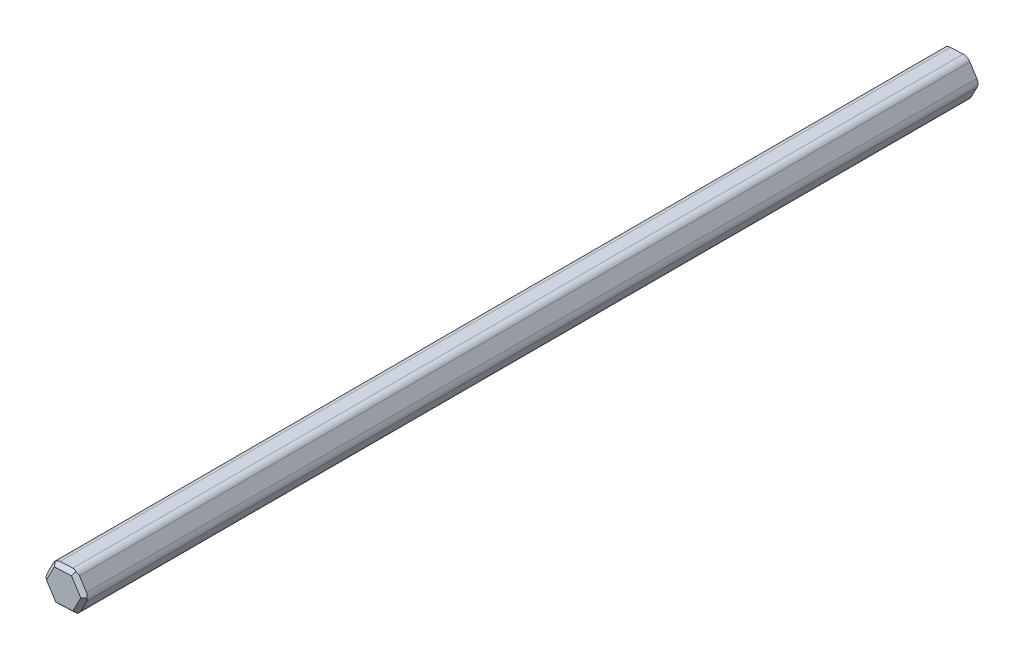
ISO-10303-21;
HEADER;
FILE_DESCRIPTION(('STEP AP214'),'2;1');
FILE_NAME('part.step','',(''),(''),'','','');
FILE_SCHEMA(('AUTOMOTIVE_DESIGN { 1 0 10303 214 1 1 1 1 }'));
ENDSEC;
DATA;
#1=APPLICATION_CONTEXT('core data for automotive mechanical design processes');
#2=APPLICATION_PROTOCOL_DEFINITION('international standard','automotive_design',2000,#1);
#3=PRODUCT_CONTEXT('',#1,'mechanical');
#4=PRODUCT('Part','Part','',(#3));
#5=PRODUCT_RELATED_PRODUCT_CATEGORY('part','',(#4));
#6=PRODUCT_DEFINITION_FORMATION('','',#4);
#7=PRODUCT_DEFINITION_CONTEXT('part definition',#1,'design');
#8=PRODUCT_DEFINITION('design','',#6,#7);
#9=PRODUCT_DEFINITION_SHAPE('','',#8);
#10=(LENGTH_UNIT() NAMED_UNIT(*) SI_UNIT(.MILLI.,.METRE.));
#11=(NAMED_UNIT(*) PLANE_ANGLE_UNIT() SI_UNIT($,.RADIAN.));
#12=(NAMED_UNIT(*) SI_UNIT($,.STERADIAN.) SOLID_ANGLE_UNIT());
#13=UNCERTAINTY_MEASURE_WITH_UNIT(LENGTH_MEASURE(1.E-05),#10,'distance_accuracy_value','');
#14=(GEOMETRIC_REPRESENTATION_CONTEXT(3) GLOBAL_UNCERTAINTY_ASSIGNED_CONTEXT((#13)) GLOBAL_UNIT_ASSIGNED_CONTEXT((#10,
#11,#12)) REPRESENTATION_CONTEXT('',''));
#15=CARTESIAN_POINT('',(0.,0.,0.));
#16=DIRECTION('',(0.,0.,1.));
#17=DIRECTION('',(1.,0.,0.));
#18=AXIS2_PLACEMENT_3D('',#15,#16,#17);
#19=CARTESIAN_POINT('',(0.673520983785885,1.30265222439968,60.96));
#20=DIRECTION('',(0.04639702478252,-0.998923078165346,0.));
#21=DIRECTION('',(0.998923078165346,0.04639702478252,0.));
#22=AXIS2_PLACEMENT_3D('',#19,#20,#21);
#23=PLANE('',#22);
#24=DIRECTION('',(-0.998923078165346,-0.04639702478252,0.));
#25=VECTOR('',#24,1.);
#26=CARTESIAN_POINT('',(0.673520983785885,1.30265222439968,0.));
#27=LINE('',#26,#25);
#28=CARTESIAN_POINT('',(0.380542901682011,1.2890442583478,0.));
#29=VERTEX_POINT('',#28);
#30=CARTESIAN_POINT('',(-0.498391344629611,1.24822036019218,0.));
#31=VERTEX_POINT('',#30);
#32=EDGE_CURVE('E225',#29,#31,#27,.T.);
#33=ORIENTED_EDGE('',*,*,#32,.T.);
#34=DIRECTION('',(0.,0.,-1.));
#35=VECTOR('',#34,1.);
#36=CARTESIAN_POINT('',(-0.498391344629611,1.24822036019218,60.96));
#37=LINE('',#36,#35);
#38=CARTESIAN_POINT('',(-0.498391344629611,1.24822036019218,60.706));
#39=VERTEX_POINT('',#38);
#40=EDGE_CURVE('E245',#31,#39,#37,.F.);
#41=ORIENTED_EDGE('',*,*,#40,.T.);
#42=DIRECTION('',(0.998923078165346,0.04639702478252,0.));
#43=VECTOR('',#42,1.);
#44=CARTESIAN_POINT('',(0.673520983785885,1.30265222439968,60.706));
#45=LINE('',#44,#43);
#46=CARTESIAN_POINT('',(0.380542901682011,1.2890442583478,60.706));
#47=VERTEX_POINT('',#46);
#48=EDGE_CURVE('E211',#39,#47,#45,.T.);
#49=ORIENTED_EDGE('',*,*,#48,.T.);
#50=DIRECTION('',(0.,0.,-1.));
#51=VECTOR('',#50,1.);
#52=CARTESIAN_POINT('',(0.380542901682011,1.2890442583478,60.96));
#53=LINE('',#52,#51);
#54=EDGE_CURVE('E242',#47,#29,#53,.T.);
#55=ORIENTED_EDGE('',*,*,#54,.T.);
#56=EDGE_LOOP('',(#33,#41,#49,#55));
#57=FACE_BOUND('',#56,.T.);
#58=ADVANCED_FACE('F33',(#57),#23,.F.);
#59=CARTESIAN_POINT('',(-0.791369426733485,1.2346123941403,60.96));
#60=DIRECTION('',(0.888291274508999,-0.459280536960994,0.));
#61=DIRECTION('',(0.459280536960994,0.888291274508999,0.));
#62=AXIS2_PLACEMENT_3D('',#59,#60,#61);
#63=PLANE('',#62);
#64=DIRECTION('',(0.459280536960994,0.888291274508999,0.));
#65=VECTOR('',#64,1.);
#66=CARTESIAN_POINT('',(-0.791369426733485,1.2346123941403,60.706));
#67=LINE('',#66,#65);
#68=CARTESIAN_POINT('',(-1.33018621376219,0.192490614620559,60.706));
#69=VERTEX_POINT('',#68);
#70=CARTESIAN_POINT('',(-0.926073623490662,0.974081949260367,60.706));
#71=VERTEX_POINT('',#70);
#72=EDGE_CURVE('E214',#69,#71,#67,.T.);
#73=ORIENTED_EDGE('',*,*,#72,.T.);
#74=DIRECTION('',(0.,0.,-1.));
#75=VECTOR('',#74,1.);
#76=CARTESIAN_POINT('',(-0.926073623490662,0.974081949260367,60.96));
#77=LINE('',#76,#75);
#78=CARTESIAN_POINT('',(-0.926073623490662,0.974081949260367,0.));
#79=VERTEX_POINT('',#78);
#80=EDGE_CURVE('E227',#71,#79,#77,.T.);
#81=ORIENTED_EDGE('',*,*,#80,.T.);
#82=DIRECTION('',(-0.459280536960994,-0.888291274508999,0.));
#83=VECTOR('',#82,1.);
#84=CARTESIAN_POINT('',(-0.791369426733485,1.2346123941403,0.));
#85=LINE('',#84,#83);
#86=CARTESIAN_POINT('',(-1.33018621376219,0.192490614620559,0.));
#87=VERTEX_POINT('',#86);
#88=EDGE_CURVE('E311',#79,#87,#85,.T.);
#89=ORIENTED_EDGE('',*,*,#88,.T.);
#90=DIRECTION('',(0.,0.,-1.));
#91=VECTOR('',#90,1.);
#92=CARTESIAN_POINT('',(-1.33018621376219,0.192490614620559,60.96));
#93=LINE('',#92,#91);
#94=EDGE_CURVE('E217',#87,#69,#93,.F.);
#95=ORIENTED_EDGE('',*,*,#94,.T.);
#96=EDGE_LOOP('',(#73,#81,#89,#95));
#97=FACE_BOUND('',#96,.T.);
#98=ADVANCED_FACE('F308',(#97),#63,.F.);
#99=CARTESIAN_POINT('',(-1.46489041051937,-0.0680398302593764,60.96));
#100=DIRECTION('',(0.841894249726478,0.539642541204352,0.));
#101=DIRECTION('',(-0.539642541204352,0.841894249726478,0.));
#102=AXIS2_PLACEMENT_3D('',#99,#100,#101);
#103=PLANE('',#102);
#104=DIRECTION('',(-0.539642541204352,0.841894249726478,0.));
#105=VECTOR('',#104,1.);
#106=CARTESIAN_POINT('',(-1.46489041051937,-0.0680398302593764,60.706));
#107=LINE('',#106,#105);
#108=CARTESIAN_POINT('',(-0.831794869132581,-1.05572974557162,60.706));
#109=VERTEX_POINT('',#108);
#110=CARTESIAN_POINT('',(-1.30661652517267,-0.314962309087437,60.706));
#111=VERTEX_POINT('',#110);
#112=EDGE_CURVE('E200',#109,#111,#107,.T.);
#113=ORIENTED_EDGE('',*,*,#112,.T.);
#114=DIRECTION('',(0.,0.,-1.));
#115=VECTOR('',#114,1.);
#116=CARTESIAN_POINT('',(-1.30661652517267,-0.314962309087437,60.96));
#117=LINE('',#116,#115);
#118=CARTESIAN_POINT('',(-1.30661652517267,-0.314962309087437,0.));
#119=VERTEX_POINT('',#118);
#120=EDGE_CURVE('E274',#111,#119,#117,.T.);
#121=ORIENTED_EDGE('',*,*,#120,.T.);
#122=DIRECTION('',(0.539642541204352,-0.841894249726478,0.));
#123=VECTOR('',#122,1.);
#124=CARTESIAN_POINT('',(-1.46489041051937,-0.0680398302593764,0.));
#125=LINE('',#124,#123);
#126=CARTESIAN_POINT('',(-0.831794869132581,-1.05572974557162,0.));
#127=VERTEX_POINT('',#126);
#128=EDGE_CURVE('E341',#119,#127,#125,.T.);
#129=ORIENTED_EDGE('',*,*,#128,.T.);
#130=DIRECTION('',(0.,0.,-1.));
#131=VECTOR('',#130,1.);
#132=CARTESIAN_POINT('',(-0.831794869132581,-1.05572974557162,60.96));
#133=LINE('',#132,#131);
#134=EDGE_CURVE('E272',#127,#109,#133,.F.);
#135=ORIENTED_EDGE('',*,*,#134,.T.);
#136=EDGE_LOOP('',(#113,#121,#129,#135));
#137=FACE_BOUND('',#136,.T.);
#138=ADVANCED_FACE('F350',(#137),#103,.F.);
#139=CARTESIAN_POINT('',(-0.673520983785884,-1.30265222439968,60.96));
#140=DIRECTION('',(-0.0463970247825201,0.998923078165346,0.));
#141=DIRECTION('',(-0.998923078165346,-0.0463970247825201,0.));
#142=AXIS2_PLACEMENT_3D('',#139,#140,#141);
#143=PLANE('',#142);
#144=DIRECTION('',(0.998923078165346,0.0463970247825201,0.));
#145=VECTOR('',#144,1.);
#146=CARTESIAN_POINT('',(-0.673520983785884,-1.30265222439968,0.));
#147=LINE('',#146,#145);
#148=CARTESIAN_POINT('',(-0.380542901682009,-1.2890442583478,0.));
#149=VERTEX_POINT('',#148);
#150=CARTESIAN_POINT('',(0.498391344629613,-1.24822036019218,0.));
#151=VERTEX_POINT('',#150);
#152=EDGE_CURVE('E340',#149,#151,#147,.T.);
#153=ORIENTED_EDGE('',*,*,#152,.T.);
#154=DIRECTION('',(0.,0.,-1.));
#155=VECTOR('',#154,1.);
#156=CARTESIAN_POINT('',(0.498391344629612,-1.24822036019218,60.96));
#157=LINE('',#156,#155);
#158=CARTESIAN_POINT('',(0.498391344629612,-1.24822036019218,60.706));
#159=VERTEX_POINT('',#158);
#160=EDGE_CURVE('E262',#151,#159,#157,.F.);
#161=ORIENTED_EDGE('',*,*,#160,.T.);
#162=DIRECTION('',(-0.998923078165346,-0.0463970247825201,0.));
#163=VECTOR('',#162,1.);
#164=CARTESIAN_POINT('',(-0.673520983785884,-1.30265222439968,60.706));
#165=LINE('',#164,#163);
#166=CARTESIAN_POINT('',(-0.38054290168201,-1.2890442583478,60.706));
#167=VERTEX_POINT('',#166);
#168=EDGE_CURVE('E203',#159,#167,#165,.T.);
#169=ORIENTED_EDGE('',*,*,#168,.T.);
#170=DIRECTION('',(0.,0.,-1.));
#171=VECTOR('',#170,1.);
#172=CARTESIAN_POINT('',(-0.38054290168201,-1.2890442583478,60.96));
#173=LINE('',#172,#171);
#174=EDGE_CURVE('E259',#167,#149,#173,.T.);
#175=ORIENTED_EDGE('',*,*,#174,.T.);
#176=EDGE_LOOP('',(#153,#161,#169,#175));
#177=FACE_BOUND('',#176,.T.);
#178=ADVANCED_FACE('F359',(#177),#143,.F.);
#179=CARTESIAN_POINT('',(0.791369426733486,-1.2346123941403,60.96));
#180=DIRECTION('',(-0.888291274508999,0.459280536960994,0.));
#181=DIRECTION('',(-0.459280536960994,-0.888291274508999,0.));
#182=AXIS2_PLACEMENT_3D('',#179,#180,#181);
#183=PLANE('',#182);
#184=DIRECTION('',(-0.459280536960994,-0.888291274508999,0.));
#185=VECTOR('',#184,1.);
#186=CARTESIAN_POINT('',(0.791369426733486,-1.2346123941403,60.706));
#187=LINE('',#186,#185);
#188=CARTESIAN_POINT('',(1.33018621376219,-0.192490614620559,60.706));
#189=VERTEX_POINT('',#188);
#190=CARTESIAN_POINT('',(0.926073623490663,-0.974081949260367,60.706));
#191=VERTEX_POINT('',#190);
#192=EDGE_CURVE('E206',#189,#191,#187,.T.);
#193=ORIENTED_EDGE('',*,*,#192,.T.);
#194=DIRECTION('',(0.,0.,-1.));
#195=VECTOR('',#194,1.);
#196=CARTESIAN_POINT('',(0.926073623490663,-0.974081949260367,60.96));
#197=LINE('',#196,#195);
#198=CARTESIAN_POINT('',(0.926073623490663,-0.974081949260367,0.));
#199=VERTEX_POINT('',#198);
#200=EDGE_CURVE('E256',#191,#199,#197,.T.);
#201=ORIENTED_EDGE('',*,*,#200,.T.);
#202=DIRECTION('',(0.459280536960994,0.888291274508999,0.));
#203=VECTOR('',#202,1.);
#204=CARTESIAN_POINT('',(0.791369426733486,-1.2346123941403,0.));
#205=LINE('',#204,#203);
#206=CARTESIAN_POINT('',(1.33018621376219,-0.192490614620559,0.));
#207=VERTEX_POINT('',#206);
#208=EDGE_CURVE('E188',#199,#207,#205,.T.);
#209=ORIENTED_EDGE('',*,*,#208,.T.);
#210=DIRECTION('',(0.,0.,-1.));
#211=VECTOR('',#210,1.);
#212=CARTESIAN_POINT('',(1.33018621376219,-0.192490614620559,60.96));
#213=LINE('',#212,#211);
#214=EDGE_CURVE('E254',#207,#189,#213,.F.);
#215=ORIENTED_EDGE('',*,*,#214,.T.);
#216=EDGE_LOOP('',(#193,#201,#209,#215));
#217=FACE_BOUND('',#216,.T.);
#218=ADVANCED_FACE('F332',(#217),#183,.F.);
#219=CARTESIAN_POINT('',(1.46489041051937,0.0680398302593764,60.96));
#220=DIRECTION('',(-0.841894249726478,-0.539642541204352,0.));
#221=DIRECTION('',(0.539642541204352,-0.841894249726478,0.));
#222=AXIS2_PLACEMENT_3D('',#219,#220,#221);
#223=PLANE('',#222);
#224=DIRECTION('',(-0.539642541204352,0.841894249726478,0.));
#225=VECTOR('',#224,1.);
#226=CARTESIAN_POINT('',(1.46489041051937,0.0680398302593764,0.));
#227=LINE('',#226,#225);
#228=CARTESIAN_POINT('',(1.30661652517267,0.314962309087437,0.));
#229=VERTEX_POINT('',#228);
#230=CARTESIAN_POINT('',(0.831794869132581,1.05572974557162,0.));
#231=VERTEX_POINT('',#230);
#232=EDGE_CURVE('E186',#229,#231,#227,.T.);
#233=ORIENTED_EDGE('',*,*,#232,.T.);
#234=DIRECTION('',(0.,0.,-1.));
#235=VECTOR('',#234,1.);
#236=CARTESIAN_POINT('',(0.831794869132582,1.05572974557162,60.96));
#237=LINE('',#236,#235);
#238=CARTESIAN_POINT('',(0.831794869132582,1.05572974557162,60.706));
#239=VERTEX_POINT('',#238);
#240=EDGE_CURVE('E54',#231,#239,#237,.F.);
#241=ORIENTED_EDGE('',*,*,#240,.T.);
#242=DIRECTION('',(0.539642541204352,-0.841894249726478,0.));
#243=VECTOR('',#242,1.);
#244=CARTESIAN_POINT('',(1.46489041051937,0.0680398302593764,60.706));
#245=LINE('',#244,#243);
#246=CARTESIAN_POINT('',(1.30661652517267,0.314962309087437,60.706));
#247=VERTEX_POINT('',#246);
#248=EDGE_CURVE('E209',#239,#247,#245,.T.);
#249=ORIENTED_EDGE('',*,*,#248,.T.);
#250=DIRECTION('',(0.,0.,-1.));
#251=VECTOR('',#250,1.);
#252=CARTESIAN_POINT('',(1.30661652517267,0.314962309087437,60.96));
#253=LINE('',#252,#251);
#254=EDGE_CURVE('E281',#247,#229,#253,.T.);
#255=ORIENTED_EDGE('',*,*,#254,.T.);
#256=EDGE_LOOP('',(#233,#241,#249,#255));
#257=FACE_BOUND('',#256,.T.);
#258=ADVANCED_FACE('F286',(#257),#223,.F.);
#259=CARTESIAN_POINT('',(0.,0.,60.96));
#260=DIRECTION('',(0.,0.,1.));
#261=DIRECTION('',(1.,0.,0.));
#262=AXIS2_PLACEMENT_3D('',#259,#260,#261);
#263=PLANE('',#262);
#264=DIRECTION('',(-0.459280536960994,-0.888291274508999,0.));
#265=VECTOR('',#264,1.);
#266=CARTESIAN_POINT('',(-1.23926442679409,-0.184697086647467,60.96));
#267=LINE('',#266,#265);
#268=CARTESIAN_POINT('',(-0.633095541386791,0.987689915312246,60.96));
#269=VERTEX_POINT('',#268);
#270=CARTESIAN_POINT('',(-1.1719123284155,-0.0544318642075016,60.96));
#271=VERTEX_POINT('',#270);
#272=EDGE_CURVE('E162',#269,#271,#267,.T.);
#273=ORIENTED_EDGE('',*,*,#272,.T.);
#274=DIRECTION('',(0.539642541204352,-0.841894249726478,0.));
#275=VECTOR('',#274,1.);
#276=CARTESIAN_POINT('',(-0.459679844355362,-1.16558301893377,60.96));
#277=LINE('',#276,#275);
#278=CARTESIAN_POINT('',(-0.538816787028709,-1.04212177951975,60.96));
#279=VERTEX_POINT('',#278);
#280=EDGE_CURVE('E198',#271,#279,#277,.T.);
#281=ORIENTED_EDGE('',*,*,#280,.T.);
#282=DIRECTION('',(0.998923078165346,0.0463970247825201,0.));
#283=VECTOR('',#282,1.);
#284=CARTESIAN_POINT('',(0.779584582438726,-0.980885932286309,60.96));
#285=LINE('',#284,#283);
#286=CARTESIAN_POINT('',(0.633095541386791,-0.987689915312246,60.96));
#287=VERTEX_POINT('',#286);
#288=EDGE_CURVE('E195',#279,#287,#285,.T.);
#289=ORIENTED_EDGE('',*,*,#288,.T.);
#290=DIRECTION('',(0.459280536960994,0.888291274508999,0.));
#291=VECTOR('',#290,1.);
#292=CARTESIAN_POINT('',(1.23926442679409,0.184697086647467,60.96));
#293=LINE('',#292,#291);
#294=CARTESIAN_POINT('',(1.1719123284155,0.0544318642075016,60.96));
#295=VERTEX_POINT('',#294);
#296=EDGE_CURVE('E193',#287,#295,#293,.T.);
#297=ORIENTED_EDGE('',*,*,#296,.T.);
#298=DIRECTION('',(-0.539642541204352,0.841894249726478,0.));
#299=VECTOR('',#298,1.);
#300=CARTESIAN_POINT('',(0.459679844355363,1.16558301893377,60.96));
#301=LINE('',#300,#299);
#302=CARTESIAN_POINT('',(0.53881678702871,1.04212177951975,60.96));
#303=VERTEX_POINT('',#302);
#304=EDGE_CURVE('E166',#295,#303,#301,.T.);
#305=ORIENTED_EDGE('',*,*,#304,.T.);
#306=DIRECTION('',(-0.998923078165346,-0.04639702478252,0.));
#307=VECTOR('',#306,1.);
#308=CARTESIAN_POINT('',(-0.779584582438726,0.980885932286309,60.96));
#309=LINE('',#308,#307);
#310=EDGE_CURVE('E157',#303,#269,#309,.T.);
#311=ORIENTED_EDGE('',*,*,#310,.T.);
#312=EDGE_LOOP('',(#273,#281,#289,#297,#305,#311));
#313=FACE_BOUND('',#312,.T.);
#314=ADVANCED_FACE('F159',(#313),#263,.T.);
#315=CARTESIAN_POINT('',(0.,0.,0.));
#316=DIRECTION('',(0.,0.,1.));
#317=DIRECTION('',(1.,0.,0.));
#318=AXIS2_PLACEMENT_3D('',#315,#316,#317);
#319=PLANE('',#318);
#320=ORIENTED_EDGE('',*,*,#88,.F.);
#321=CARTESIAN_POINT('',(-0.474821656040091,0.740767436484182,0.));
#322=DIRECTION('',(0.,0.,1.));
#323=DIRECTION('',(1.,0.,0.));
#324=AXIS2_PLACEMENT_3D('',#321,#322,#323);
#325=CIRCLE('',#324,0.508);
#326=EDGE_CURVE('E240',#79,#31,#325,.F.);
#327=ORIENTED_EDGE('',*,*,#326,.T.);
#328=ORIENTED_EDGE('',*,*,#32,.F.);
#329=CARTESIAN_POINT('',(0.404112590271531,0.781591334639807,0.));
#330=DIRECTION('',(0.,0.,1.));
#331=DIRECTION('',(1.,0.,0.));
#332=AXIS2_PLACEMENT_3D('',#329,#330,#331);
#333=CIRCLE('',#332,0.508);
#334=EDGE_CURVE('E232',#29,#231,#333,.F.);
#335=ORIENTED_EDGE('',*,*,#334,.T.);
#336=ORIENTED_EDGE('',*,*,#232,.F.);
#337=CARTESIAN_POINT('',(0.878934246311623,0.0408238981556259,0.));
#338=DIRECTION('',(0.,0.,1.));
#339=DIRECTION('',(1.,0.,0.));
#340=AXIS2_PLACEMENT_3D('',#337,#338,#339);
#341=CIRCLE('',#340,0.508);
#342=EDGE_CURVE('E230',#229,#207,#341,.F.);
#343=ORIENTED_EDGE('',*,*,#342,.T.);
#344=ORIENTED_EDGE('',*,*,#208,.F.);
#345=CARTESIAN_POINT('',(0.474821656040092,-0.740767436484182,0.));
#346=DIRECTION('',(0.,0.,1.));
#347=DIRECTION('',(1.,0.,0.));
#348=AXIS2_PLACEMENT_3D('',#345,#346,#347);
#349=CIRCLE('',#348,0.508);
#350=EDGE_CURVE('E238',#199,#151,#349,.F.);
#351=ORIENTED_EDGE('',*,*,#350,.T.);
#352=ORIENTED_EDGE('',*,*,#152,.F.);
#353=CARTESIAN_POINT('',(-0.40411259027153,-0.781591334639807,0.));
#354=DIRECTION('',(0.,0.,1.));
#355=DIRECTION('',(1.,0.,0.));
#356=AXIS2_PLACEMENT_3D('',#353,#354,#355);
#357=CIRCLE('',#356,0.508);
#358=EDGE_CURVE('E234',#149,#127,#357,.F.);
#359=ORIENTED_EDGE('',*,*,#358,.T.);
#360=ORIENTED_EDGE('',*,*,#128,.F.);
#361=CARTESIAN_POINT('',(-0.878934246311622,-0.0408238981556259,0.));
#362=DIRECTION('',(0.,0.,1.));
#363=DIRECTION('',(1.,0.,0.));
#364=AXIS2_PLACEMENT_3D('',#361,#362,#363);
#365=CIRCLE('',#364,0.508);
#366=EDGE_CURVE('E236',#119,#87,#365,.F.);
#367=ORIENTED_EDGE('',*,*,#366,.T.);
#368=EDGE_LOOP('',(#320,#327,#328,#335,#336,#343,#344,#351,#352,#359,#360,#367));
#369=FACE_BOUND('',#368,.T.);
#370=ADVANCED_FACE('F290',(#369),#319,.F.);
#371=CARTESIAN_POINT('',(0.855364557722106,0.548276821863624,60.96));
#372=DIRECTION('',(0.595309133023555,0.381584900302339,0.707106781186546));
#373=DIRECTION('',(0.539642541204352,-0.841894249726478,0.));
#374=AXIS2_PLACEMENT_3D('',#371,#372,#373);
#375=PLANE('',#374);
#376=ORIENTED_EDGE('',*,*,#248,.F.);
#377=CARTESIAN_POINT('',(0.404112590271531,0.781591334639807,61.214));
#378=DIRECTION('',(0.595309133023555,0.381584900302339,0.707106781186546));
#379=DIRECTION('',(0.595309133023552,0.381584900302337,-0.70710678118655));
#380=AXIS2_PLACEMENT_3D('',#377,#378,#379);
#381=ELLIPSE('',#380,0.718420489685534,0.508);
#382=CARTESIAN_POINT('',(0.637427103047716,1.23284330209038,60.7740590948775));
#383=VERTEX_POINT('',#382);
#384=EDGE_CURVE('E11',#239,#383,#381,.T.);
#385=ORIENTED_EDGE('',*,*,#384,.T.);
#386=DIRECTION('',(0.347183452231714,0.671485086896975,-0.65465367070798));
#387=VECTOR('',#386,1.);
#388=CARTESIAN_POINT('',(0.461842960310323,0.893247239588356,61.1051428571429));
#389=LINE('',#388,#387);
#390=EDGE_CURVE('E223',#303,#383,#389,.T.);
#391=ORIENTED_EDGE('',*,*,#390,.F.);
#392=ORIENTED_EDGE('',*,*,#304,.F.);
#393=DIRECTION('',(0.755114869631038,0.0350728540422428,-0.654653670707979));
#394=VECTOR('',#393,1.);
#395=CARTESIAN_POINT('',(1.004496281499,0.0466558836064298,61.1051428571429));
#396=LINE('',#395,#394);
#397=CARTESIAN_POINT('',(1.38638717001962,0.0643935867451464,60.7740590948775));
#398=VERTEX_POINT('',#397);
#399=EDGE_CURVE('E179',#398,#295,#396,.F.);
#400=ORIENTED_EDGE('',*,*,#399,.F.);
#401=CARTESIAN_POINT('',(0.878934246311623,0.0408238981556259,61.214));
#402=DIRECTION('',(0.595309133023555,0.381584900302339,0.707106781186546));
#403=DIRECTION('',(0.595309133023552,0.381584900302337,-0.70710678118655));
#404=AXIS2_PLACEMENT_3D('',#401,#402,#403);
#405=ELLIPSE('',#404,0.718420489685534,0.508);
#406=EDGE_CURVE('E41',#398,#247,#405,.T.);
#407=ORIENTED_EDGE('',*,*,#406,.T.);
#408=EDGE_LOOP('',(#376,#385,#391,#392,#400,#407));
#409=FACE_BOUND('',#408,.T.);
#410=ADVANCED_FACE('F329',(#409),#375,.T.);
#411=CARTESIAN_POINT('',(-0.0471393771790405,1.014905847416,60.96));
#412=DIRECTION('',(-0.0328076508506003,0.706345282454458,0.707106781186545));
#413=DIRECTION('',(0.998923078165346,0.04639702478252,0.));
#414=AXIS2_PLACEMENT_3D('',#411,#412,#413);
#415=PLANE('',#414);
#416=ORIENTED_EDGE('',*,*,#48,.F.);
#417=CARTESIAN_POINT('',(-0.474821656040091,0.740767436484182,61.214));
#418=DIRECTION('',(-0.0328076508506003,0.706345282454458,0.707106781186545));
#419=DIRECTION('',(-0.0328076508506001,0.706345282454453,-0.70710678118655));
#420=AXIS2_PLACEMENT_3D('',#417,#418,#419);
#421=ELLIPSE('',#420,0.718420489685535,0.508);
#422=CARTESIAN_POINT('',(-0.748960066971902,1.16844971534523,60.7740590948775));
#423=VERTEX_POINT('',#422);
#424=EDGE_CURVE('E176',#39,#423,#421,.T.);
#425=ORIENTED_EDGE('',*,*,#424,.T.);
#426=DIRECTION('',(-0.407931417399326,0.636412232854732,-0.654653670707979));
#427=VECTOR('',#426,1.);
#428=CARTESIAN_POINT('',(-0.542653321188678,0.846591355981926,61.1051428571429));
#429=LINE('',#428,#427);
#430=EDGE_CURVE('E172',#269,#423,#429,.T.);
#431=ORIENTED_EDGE('',*,*,#430,.F.);
#432=ORIENTED_EDGE('',*,*,#310,.F.);
#433=ORIENTED_EDGE('',*,*,#390,.T.);
#434=CARTESIAN_POINT('',(0.404112590271531,0.781591334639807,61.214));
#435=DIRECTION('',(-0.0328076508506003,0.706345282454458,0.707106781186545));
#436=DIRECTION('',(-0.0328076508506001,0.706345282454453,-0.70710678118655));
#437=AXIS2_PLACEMENT_3D('',#434,#435,#436);
#438=ELLIPSE('',#437,0.718420489685535,0.508);
#439=EDGE_CURVE('E247',#383,#47,#438,.T.);
#440=ORIENTED_EDGE('',*,*,#439,.T.);
#441=EDGE_LOOP('',(#416,#425,#431,#432,#433,#440));
#442=FACE_BOUND('',#441,.T.);
#443=ADVANCED_FACE('F174',(#442),#415,.T.);
#444=CARTESIAN_POINT('',(0.902503934901147,-0.466629025552372,60.96));
#445=DIRECTION('',(0.628116783874156,-0.324760382152119,0.707106781186545));
#446=DIRECTION('',(-0.459280536960994,-0.888291274508999,0.));
#447=AXIS2_PLACEMENT_3D('',#444,#445,#446);
#448=PLANE('',#447);
#449=DIRECTION('',(0.407931417399326,-0.636412232854732,-0.65465367070798));
#450=VECTOR('',#449,1.);
#451=CARTESIAN_POINT('',(0.542653321188679,-0.846591355981927,61.1051428571429));
#452=LINE('',#451,#450);
#453=CARTESIAN_POINT('',(0.748960066971903,-1.16844971534523,60.7740590948775));
#454=VERTEX_POINT('',#453);
#455=EDGE_CURVE('E180',#454,#287,#452,.F.);
#456=ORIENTED_EDGE('',*,*,#455,.F.);
#457=CARTESIAN_POINT('',(0.474821656040092,-0.740767436484182,61.214));
#458=DIRECTION('',(0.628116783874156,-0.324760382152119,0.707106781186545));
#459=DIRECTION('',(0.628116783874152,-0.324760382152117,-0.70710678118655));
#460=AXIS2_PLACEMENT_3D('',#457,#458,#459);
#461=ELLIPSE('',#460,0.718420489685535,0.508);
#462=EDGE_CURVE('E270',#454,#191,#461,.T.);
#463=ORIENTED_EDGE('',*,*,#462,.T.);
#464=ORIENTED_EDGE('',*,*,#192,.F.);
#465=CARTESIAN_POINT('',(0.878934246311623,0.0408238981556259,61.214));
#466=DIRECTION('',(0.628116783874156,-0.324760382152119,0.707106781186545));
#467=DIRECTION('',(0.628116783874152,-0.324760382152117,-0.70710678118655));
#468=AXIS2_PLACEMENT_3D('',#465,#466,#467);
#469=ELLIPSE('',#468,0.718420489685535,0.508);
#470=EDGE_CURVE('E268',#189,#398,#469,.T.);
#471=ORIENTED_EDGE('',*,*,#470,.T.);
#472=ORIENTED_EDGE('',*,*,#399,.T.);
#473=ORIENTED_EDGE('',*,*,#296,.F.);
#474=EDGE_LOOP('',(#456,#463,#464,#471,#472,#473));
#475=FACE_BOUND('',#474,.T.);
#476=ADVANCED_FACE('F325',(#475),#448,.T.);
#477=CARTESIAN_POINT('',(-0.902503934901146,0.466629025552372,60.96));
#478=DIRECTION('',(-0.628116783874156,0.324760382152119,0.707106781186546));
#479=DIRECTION('',(0.459280536960994,0.888291274508999,0.));
#480=AXIS2_PLACEMENT_3D('',#477,#478,#479);
#481=PLANE('',#480);
#482=ORIENTED_EDGE('',*,*,#430,.T.);
#483=CARTESIAN_POINT('',(-0.474821656040091,0.740767436484182,61.214));
#484=DIRECTION('',(-0.628116783874156,0.324760382152119,0.707106781186546));
#485=DIRECTION('',(-0.628116783874152,0.324760382152117,-0.70710678118655));
#486=AXIS2_PLACEMENT_3D('',#483,#484,#485);
#487=ELLIPSE('',#486,0.718420489685534,0.508);
#488=EDGE_CURVE('E252',#423,#71,#487,.T.);
#489=ORIENTED_EDGE('',*,*,#488,.T.);
#490=ORIENTED_EDGE('',*,*,#72,.F.);
#491=CARTESIAN_POINT('',(-0.878934246311622,-0.0408238981556259,61.214));
#492=DIRECTION('',(-0.628116783874156,0.324760382152119,0.707106781186546));
#493=DIRECTION('',(-0.628116783874152,0.324760382152117,-0.70710678118655));
#494=AXIS2_PLACEMENT_3D('',#491,#492,#493);
#495=ELLIPSE('',#494,0.718420489685534,0.508);
#496=CARTESIAN_POINT('',(-1.38638717001962,-0.0643935867451465,60.7740590948775));
#497=VERTEX_POINT('',#496);
#498=EDGE_CURVE('E250',#69,#497,#495,.T.);
#499=ORIENTED_EDGE('',*,*,#498,.T.);
#500=DIRECTION('',(0.755114869631038,0.0350728540422425,0.65465367070798));
#501=VECTOR('',#500,1.);
#502=CARTESIAN_POINT('',(-1.004496281499,-0.0466558836064302,61.1051428571429));
#503=LINE('',#502,#501);
#504=EDGE_CURVE('E184',#271,#497,#503,.F.);
#505=ORIENTED_EDGE('',*,*,#504,.F.);
#506=ORIENTED_EDGE('',*,*,#272,.F.);
#507=EDGE_LOOP('',(#482,#489,#490,#499,#505,#506));
#508=FACE_BOUND('',#507,.T.);
#509=ADVANCED_FACE('F182',(#508),#481,.T.);
#510=CARTESIAN_POINT('',(0.0471393771790407,-1.014905847416,60.96));
#511=DIRECTION('',(0.0328076508506004,-0.706345282454458,0.707106781186545));
#512=DIRECTION('',(-0.998923078165346,-0.0463970247825201,0.));
#513=AXIS2_PLACEMENT_3D('',#510,#511,#512);
#514=PLANE('',#513);
#515=ORIENTED_EDGE('',*,*,#168,.F.);
#516=CARTESIAN_POINT('',(0.474821656040092,-0.740767436484182,61.214));
#517=DIRECTION('',(0.0328076508506004,-0.706345282454458,0.707106781186545));
#518=DIRECTION('',(0.0328076508506002,-0.706345282454453,-0.70710678118655));
#519=AXIS2_PLACEMENT_3D('',#516,#517,#518);
#520=ELLIPSE('',#519,0.718420489685535,0.508);
#521=EDGE_CURVE('E266',#159,#454,#520,.T.);
#522=ORIENTED_EDGE('',*,*,#521,.T.);
#523=ORIENTED_EDGE('',*,*,#455,.T.);
#524=ORIENTED_EDGE('',*,*,#288,.F.);
#525=DIRECTION('',(-0.347183452231714,-0.671485086896974,-0.65465367070798));
#526=VECTOR('',#525,1.);
#527=CARTESIAN_POINT('',(-0.461842960310322,-0.893247239588356,61.1051428571429));
#528=LINE('',#527,#526);
#529=CARTESIAN_POINT('',(-0.637427103047715,-1.23284330209038,60.7740590948775));
#530=VERTEX_POINT('',#529);
#531=EDGE_CURVE('E218',#530,#279,#528,.F.);
#532=ORIENTED_EDGE('',*,*,#531,.F.);
#533=CARTESIAN_POINT('',(-0.40411259027153,-0.781591334639807,61.214));
#534=DIRECTION('',(0.0328076508506004,-0.706345282454458,0.707106781186545));
#535=DIRECTION('',(0.0328076508506002,-0.706345282454453,-0.70710678118655));
#536=AXIS2_PLACEMENT_3D('',#533,#534,#535);
#537=ELLIPSE('',#536,0.718420489685535,0.508);
#538=EDGE_CURVE('E264',#530,#167,#537,.T.);
#539=ORIENTED_EDGE('',*,*,#538,.T.);
#540=EDGE_LOOP('',(#515,#522,#523,#524,#532,#539));
#541=FACE_BOUND('',#540,.T.);
#542=ADVANCED_FACE('F357',(#541),#514,.T.);
#543=CARTESIAN_POINT('',(-0.855364557722105,-0.548276821863624,60.96));
#544=DIRECTION('',(-0.595309133023555,-0.381584900302339,0.707106781186545));
#545=DIRECTION('',(-0.539642541204352,0.841894249726478,0.));
#546=AXIS2_PLACEMENT_3D('',#543,#544,#545);
#547=PLANE('',#546);
#548=ORIENTED_EDGE('',*,*,#504,.T.);
#549=CARTESIAN_POINT('',(-0.878934246311622,-0.0408238981556259,61.214));
#550=DIRECTION('',(-0.595309133023555,-0.381584900302339,0.707106781186545));
#551=DIRECTION('',(-0.595309133023551,-0.381584900302337,-0.70710678118655));
#552=AXIS2_PLACEMENT_3D('',#549,#550,#551);
#553=ELLIPSE('',#552,0.718420489685535,0.508);
#554=EDGE_CURVE('E279',#497,#111,#553,.T.);
#555=ORIENTED_EDGE('',*,*,#554,.T.);
#556=ORIENTED_EDGE('',*,*,#112,.F.);
#557=CARTESIAN_POINT('',(-0.40411259027153,-0.781591334639807,61.214));
#558=DIRECTION('',(-0.595309133023555,-0.381584900302339,0.707106781186545));
#559=DIRECTION('',(-0.595309133023551,-0.381584900302337,-0.70710678118655));
#560=AXIS2_PLACEMENT_3D('',#557,#558,#559);
#561=ELLIPSE('',#560,0.718420489685535,0.508);
#562=EDGE_CURVE('E277',#109,#530,#561,.T.);
#563=ORIENTED_EDGE('',*,*,#562,.T.);
#564=ORIENTED_EDGE('',*,*,#531,.T.);
#565=ORIENTED_EDGE('',*,*,#280,.F.);
#566=EDGE_LOOP('',(#548,#555,#556,#563,#564,#565));
#567=FACE_BOUND('',#566,.T.);
#568=ADVANCED_FACE('F317',(#567),#547,.T.);
#569=CARTESIAN_POINT('',(-0.474821656040091,0.740767436484182,60.96));
#570=DIRECTION('',(0.,0.,-1.));
#571=DIRECTION('',(-1.,0.,0.));
#572=AXIS2_PLACEMENT_3D('',#569,#570,#571);
#573=CYLINDRICAL_SURFACE('',#572,0.508);
#574=ORIENTED_EDGE('',*,*,#424,.F.);
#575=ORIENTED_EDGE('',*,*,#40,.F.);
#576=ORIENTED_EDGE('',*,*,#326,.F.);
#577=ORIENTED_EDGE('',*,*,#80,.F.);
#578=ORIENTED_EDGE('',*,*,#488,.F.);
#579=EDGE_LOOP('',(#574,#575,#576,#577,#578));
#580=FACE_BOUND('',#579,.T.);
#581=ADVANCED_FACE('F303',(#580),#573,.T.);
#582=CARTESIAN_POINT('',(0.474821656040092,-0.740767436484182,60.96));
#583=DIRECTION('',(0.,0.,-1.));
#584=DIRECTION('',(-1.,0.,0.));
#585=AXIS2_PLACEMENT_3D('',#582,#583,#584);
#586=CYLINDRICAL_SURFACE('',#585,0.508);
#587=ORIENTED_EDGE('',*,*,#521,.F.);
#588=ORIENTED_EDGE('',*,*,#160,.F.);
#589=ORIENTED_EDGE('',*,*,#350,.F.);
#590=ORIENTED_EDGE('',*,*,#200,.F.);
#591=ORIENTED_EDGE('',*,*,#462,.F.);
#592=EDGE_LOOP('',(#587,#588,#589,#590,#591));
#593=FACE_BOUND('',#592,.T.);
#594=ADVANCED_FACE('F336',(#593),#586,.T.);
#595=CARTESIAN_POINT('',(-0.878934246311622,-0.0408238981556259,60.96));
#596=DIRECTION('',(0.,0.,-1.));
#597=DIRECTION('',(-1.,0.,0.));
#598=AXIS2_PLACEMENT_3D('',#595,#596,#597);
#599=CYLINDRICAL_SURFACE('',#598,0.508);
#600=ORIENTED_EDGE('',*,*,#498,.F.);
#601=ORIENTED_EDGE('',*,*,#94,.F.);
#602=ORIENTED_EDGE('',*,*,#366,.F.);
#603=ORIENTED_EDGE('',*,*,#120,.F.);
#604=ORIENTED_EDGE('',*,*,#554,.F.);
#605=EDGE_LOOP('',(#600,#601,#602,#603,#604));
#606=FACE_BOUND('',#605,.T.);
#607=ADVANCED_FACE('F313',(#606),#599,.T.);
#608=CARTESIAN_POINT('',(-0.40411259027153,-0.781591334639807,60.96));
#609=DIRECTION('',(0.,0.,-1.));
#610=DIRECTION('',(-1.,0.,0.));
#611=AXIS2_PLACEMENT_3D('',#608,#609,#610);
#612=CYLINDRICAL_SURFACE('',#611,0.508);
#613=ORIENTED_EDGE('',*,*,#562,.F.);
#614=ORIENTED_EDGE('',*,*,#134,.F.);
#615=ORIENTED_EDGE('',*,*,#358,.F.);
#616=ORIENTED_EDGE('',*,*,#174,.F.);
#617=ORIENTED_EDGE('',*,*,#538,.F.);
#618=EDGE_LOOP('',(#613,#614,#615,#616,#617));
#619=FACE_BOUND('',#618,.T.);
#620=ADVANCED_FACE('F353',(#619),#612,.T.);
#621=CARTESIAN_POINT('',(0.404112590271531,0.781591334639807,60.96));
#622=DIRECTION('',(0.,0.,-1.));
#623=DIRECTION('',(-1.,0.,0.));
#624=AXIS2_PLACEMENT_3D('',#621,#622,#623);
#625=CYLINDRICAL_SURFACE('',#624,0.508);
#626=ORIENTED_EDGE('',*,*,#384,.F.);
#627=ORIENTED_EDGE('',*,*,#240,.F.);
#628=ORIENTED_EDGE('',*,*,#334,.F.);
#629=ORIENTED_EDGE('',*,*,#54,.F.);
#630=ORIENTED_EDGE('',*,*,#439,.F.);
#631=EDGE_LOOP('',(#626,#627,#628,#629,#630));
#632=FACE_BOUND('',#631,.T.);
#633=ADVANCED_FACE('F298',(#632),#625,.T.);
#634=CARTESIAN_POINT('',(0.878934246311623,0.0408238981556259,60.96));
#635=DIRECTION('',(0.,0.,-1.));
#636=DIRECTION('',(-1.,0.,0.));
#637=AXIS2_PLACEMENT_3D('',#634,#635,#636);
#638=CYLINDRICAL_SURFACE('',#637,0.508);
#639=ORIENTED_EDGE('',*,*,#470,.F.);
#640=ORIENTED_EDGE('',*,*,#214,.F.);
#641=ORIENTED_EDGE('',*,*,#342,.F.);
#642=ORIENTED_EDGE('',*,*,#254,.F.);
#643=ORIENTED_EDGE('',*,*,#406,.F.);
#644=EDGE_LOOP('',(#639,#640,#641,#642,#643));
#645=FACE_BOUND('',#644,.T.);
#646=ADVANCED_FACE('F35',(#645),#638,.T.);
#647=CLOSED_SHELL('',(#58,#98,#138,#178,#218,#258,#314,#370,#410,#443,#476,#509,#542,#568,#581,
#594,#607,#620,#633,#646));
#648=MANIFOLD_SOLID_BREP('B2',#647);
#649=ADVANCED_BREP_SHAPE_REPRESENTATION('',(#18,#648),#14);
#650=SHAPE_DEFINITION_REPRESENTATION(#9,#649);
ENDSEC;
END-ISO-10303-21;
